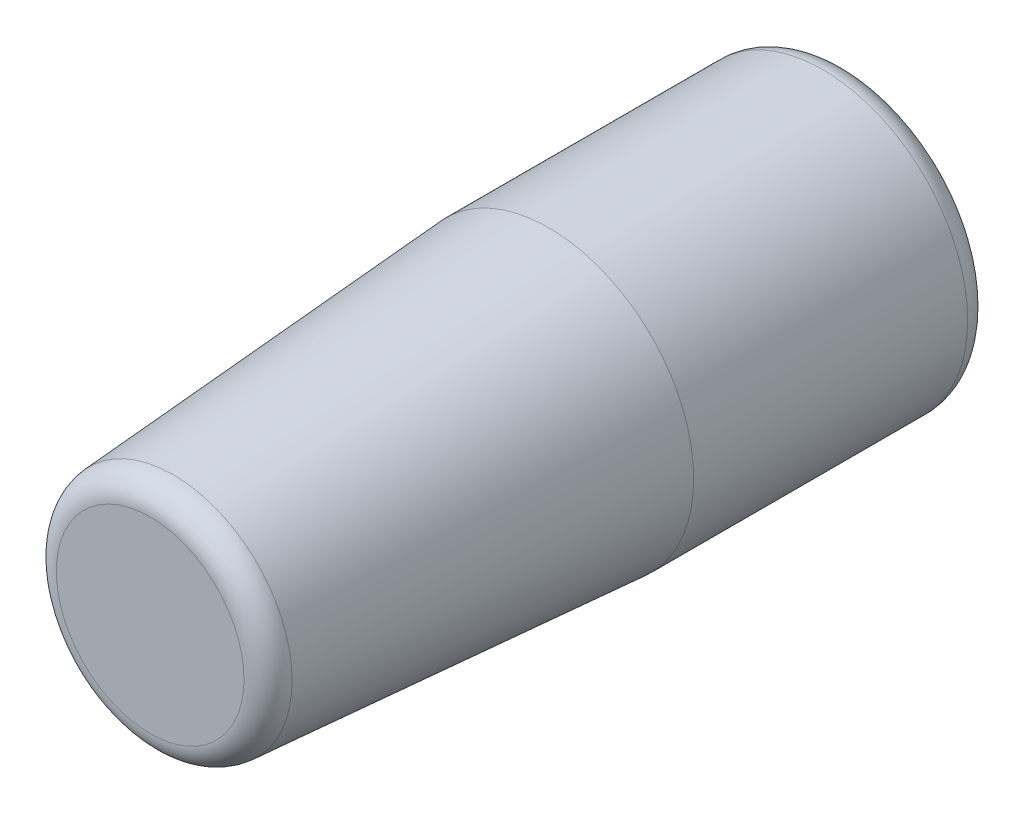
ISO-10303-21;
HEADER;
FILE_DESCRIPTION(('STEP AP214'),'2;1');
FILE_NAME('part.step','',(''),(''),'','','');
FILE_SCHEMA(('AUTOMOTIVE_DESIGN { 1 0 10303 214 1 1 1 1 }'));
ENDSEC;
DATA;
#1=APPLICATION_CONTEXT('core data for automotive mechanical design processes');
#2=APPLICATION_PROTOCOL_DEFINITION('international standard','automotive_design',2000,#1);
#3=PRODUCT_CONTEXT('',#1,'mechanical');
#4=PRODUCT('Part','Part','',(#3));
#5=PRODUCT_RELATED_PRODUCT_CATEGORY('part','',(#4));
#6=PRODUCT_DEFINITION_FORMATION('','',#4);
#7=PRODUCT_DEFINITION_CONTEXT('part definition',#1,'design');
#8=PRODUCT_DEFINITION('design','',#6,#7);
#9=PRODUCT_DEFINITION_SHAPE('','',#8);
#10=(LENGTH_UNIT() NAMED_UNIT(*) SI_UNIT(.MILLI.,.METRE.));
#11=(NAMED_UNIT(*) PLANE_ANGLE_UNIT() SI_UNIT($,.RADIAN.));
#12=(NAMED_UNIT(*) SI_UNIT($,.STERADIAN.) SOLID_ANGLE_UNIT());
#13=UNCERTAINTY_MEASURE_WITH_UNIT(LENGTH_MEASURE(1.E-05),#10,'distance_accuracy_value','');
#14=(GEOMETRIC_REPRESENTATION_CONTEXT(3) GLOBAL_UNCERTAINTY_ASSIGNED_CONTEXT((#13)) GLOBAL_UNIT_ASSIGNED_CONTEXT((#10,
#11,#12)) REPRESENTATION_CONTEXT('',''));
#15=CARTESIAN_POINT('',(0.,0.,0.));
#16=DIRECTION('',(0.,0.,1.));
#17=DIRECTION('',(1.,0.,0.));
#18=AXIS2_PLACEMENT_3D('',#15,#16,#17);
#19=CARTESIAN_POINT('',(0.,0.,152.4));
#20=DIRECTION('',(0.,0.,-1.));
#21=DIRECTION('',(-1.,0.,0.));
#22=AXIS2_PLACEMENT_3D('',#19,#20,#21);
#23=CYLINDRICAL_SURFACE('',#22,73.914);
#24=CARTESIAN_POINT('',(0.,0.,12.7));
#25=DIRECTION('',(0.,0.,1.));
#26=DIRECTION('',(1.,0.,0.));
#27=AXIS2_PLACEMENT_3D('',#24,#25,#26);
#28=CIRCLE('',#27,73.914);
#29=CARTESIAN_POINT('',(73.914,0.,12.7));
#30=VERTEX_POINT('',#29);
#31=EDGE_CURVE('E67',#30,#30,#28,.T.);
#32=ORIENTED_EDGE('',*,*,#31,.T.);
#33=EDGE_LOOP('',(#32));
#34=FACE_BOUND('',#33,.T.);
#35=CARTESIAN_POINT('',(0.,0.,152.4));
#36=DIRECTION('',(0.,0.,1.));
#37=DIRECTION('',(1.,0.,0.));
#38=AXIS2_PLACEMENT_3D('',#35,#36,#37);
#39=CIRCLE('',#38,73.914);
#40=CARTESIAN_POINT('',(73.914,0.,152.4));
#41=VERTEX_POINT('',#40);
#42=EDGE_CURVE('E73',#41,#41,#39,.T.);
#43=ORIENTED_EDGE('',*,*,#42,.F.);
#44=EDGE_LOOP('',(#43));
#45=FACE_BOUND('',#44,.T.);
#46=ADVANCED_FACE('F49',(#34,#45),#23,.T.);
#47=CARTESIAN_POINT('',(0.,0.,0.));
#48=DIRECTION('',(0.,0.,1.));
#49=DIRECTION('',(1.,0.,0.));
#50=AXIS2_PLACEMENT_3D('',#47,#48,#49);
#51=PLANE('',#50);
#52=CARTESIAN_POINT('',(0.,0.,0.));
#53=DIRECTION('',(0.,0.,1.));
#54=DIRECTION('',(1.,0.,0.));
#55=AXIS2_PLACEMENT_3D('',#52,#53,#54);
#56=CIRCLE('',#55,61.214);
#57=CARTESIAN_POINT('',(61.214,0.,0.));
#58=VERTEX_POINT('',#57);
#59=EDGE_CURVE('E62',#58,#58,#56,.F.);
#60=ORIENTED_EDGE('',*,*,#59,.T.);
#61=EDGE_LOOP('',(#60));
#62=FACE_BOUND('',#61,.T.);
#63=ADVANCED_FACE('F81',(#62),#51,.F.);
#64=CARTESIAN_POINT('',(0.,0.,152.4));
#65=DIRECTION('',(0.,0.,-1.));
#66=DIRECTION('',(1.,0.,0.));
#67=AXIS2_PLACEMENT_3D('',#64,#65,#66);
#68=CONICAL_SURFACE('',#67,73.914,0.0698131700797733);
#69=CARTESIAN_POINT('',(0.,0.,343.78590721655));
#70=DIRECTION('',(0.,0.,-1.));
#71=DIRECTION('',(-1.,0.,0.));
#72=AXIS2_PLACEMENT_3D('',#69,#70,#71);
#73=CIRCLE('',#72,60.5309936574301);
#74=CARTESIAN_POINT('',(-60.5309936574301,0.,343.78590721655));
#75=VERTEX_POINT('',#74);
#76=EDGE_CURVE('E10',#75,#75,#73,.T.);
#77=ORIENTED_EDGE('',*,*,#76,.T.);
#78=EDGE_LOOP('',(#77));
#79=FACE_BOUND('',#78,.T.);
#80=ORIENTED_EDGE('',*,*,#42,.T.);
#81=EDGE_LOOP('',(#80));
#82=FACE_BOUND('',#81,.T.);
#83=ADVANCED_FACE('F78',(#79,#82),#68,.T.);
#84=CARTESIAN_POINT('',(0.,0.,355.6));
#85=DIRECTION('',(0.,0.,1.));
#86=DIRECTION('',(1.,0.,0.));
#87=AXIS2_PLACEMENT_3D('',#84,#85,#86);
#88=PLANE('',#87);
#89=CARTESIAN_POINT('',(0.,0.,355.6));
#90=DIRECTION('',(0.,0.,1.));
#91=DIRECTION('',(1.,0.,0.));
#92=AXIS2_PLACEMENT_3D('',#89,#90,#91);
#93=CIRCLE('',#92,47.8619302191304);
#94=CARTESIAN_POINT('',(47.8619302191304,0.,355.6));
#95=VERTEX_POINT('',#94);
#96=EDGE_CURVE('E57',#95,#95,#93,.T.);
#97=ORIENTED_EDGE('',*,*,#96,.T.);
#98=EDGE_LOOP('',(#97));
#99=FACE_BOUND('',#98,.T.);
#100=ADVANCED_FACE('F92',(#99),#88,.T.);
#101=CARTESIAN_POINT('',(0.,0.,12.7));
#102=DIRECTION('',(0.,0.,1.));
#103=DIRECTION('',(1.,0.,0.));
#104=AXIS2_PLACEMENT_3D('',#101,#102,#103);
#105=TOROIDAL_SURFACE('',#104,61.214,12.7);
#106=ORIENTED_EDGE('',*,*,#59,.F.);
#107=EDGE_LOOP('',(#106));
#108=FACE_BOUND('',#107,.T.);
#109=ORIENTED_EDGE('',*,*,#31,.F.);
#110=EDGE_LOOP('',(#109));
#111=FACE_BOUND('',#110,.T.);
#112=ADVANCED_FACE('F90',(#108,#111),#105,.T.);
#113=CARTESIAN_POINT('',(0.,0.,342.9));
#114=DIRECTION('',(0.,0.,1.));
#115=DIRECTION('',(1.,0.,0.));
#116=AXIS2_PLACEMENT_3D('',#113,#114,#115);
#117=TOROIDAL_SURFACE('',#116,47.8619302191304,12.7);
#118=ORIENTED_EDGE('',*,*,#76,.F.);
#119=EDGE_LOOP('',(#118));
#120=FACE_BOUND('',#119,.T.);
#121=ORIENTED_EDGE('',*,*,#96,.F.);
#122=EDGE_LOOP('',(#121));
#123=FACE_BOUND('',#122,.T.);
#124=ADVANCED_FACE('F51',(#120,#123),#117,.T.);
#125=CLOSED_SHELL('',(#46,#63,#83,#100,#112,#124));
#126=MANIFOLD_SOLID_BREP('B2',#125);
#127=ADVANCED_BREP_SHAPE_REPRESENTATION('',(#18,#126),#14);
#128=SHAPE_DEFINITION_REPRESENTATION(#9,#127);
ENDSEC;
END-ISO-10303-21;
